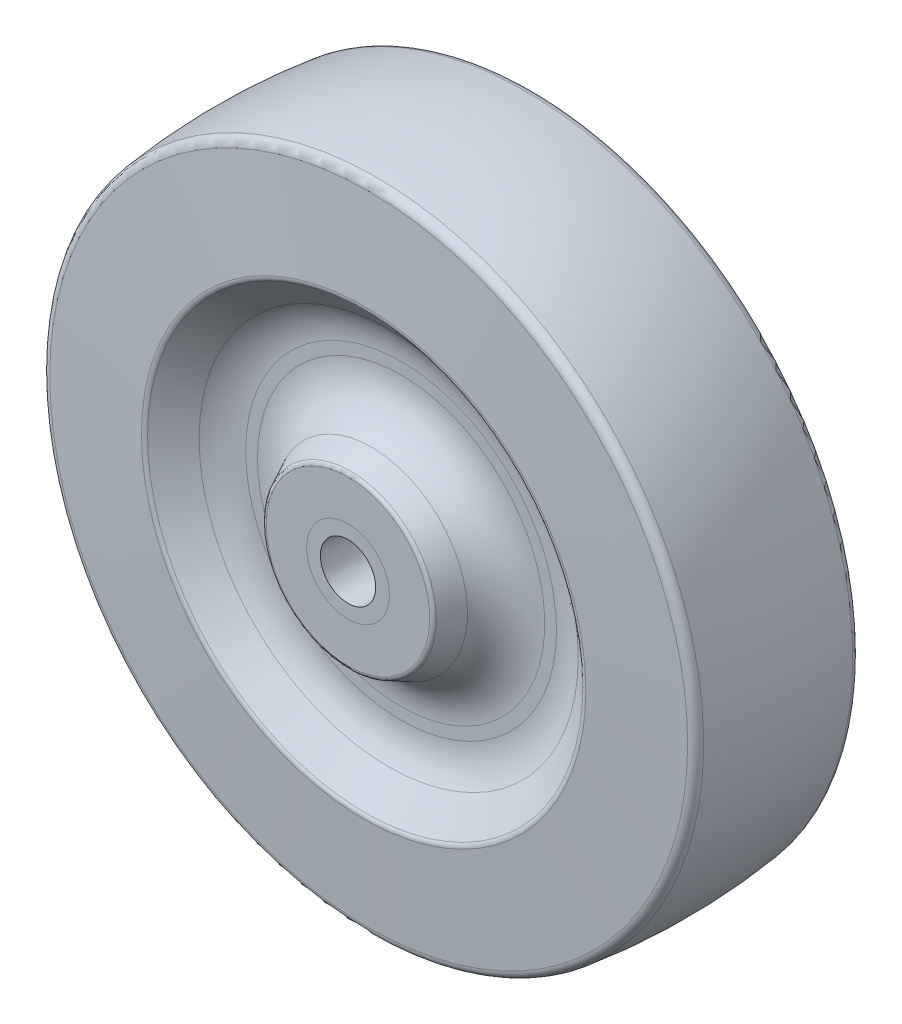
ISO-10303-21;
HEADER;
FILE_DESCRIPTION(('STEP AP214'),'2;1');
FILE_NAME('part.step','',(''),(''),'','','');
FILE_SCHEMA(('AUTOMOTIVE_DESIGN { 1 0 10303 214 1 1 1 1 }'));
ENDSEC;
DATA;
#1=APPLICATION_CONTEXT('core data for automotive mechanical design processes');
#2=APPLICATION_PROTOCOL_DEFINITION('international standard','automotive_design',2000,#1);
#3=PRODUCT_CONTEXT('',#1,'mechanical');
#4=PRODUCT('Part','Part','',(#3));
#5=PRODUCT_RELATED_PRODUCT_CATEGORY('part','',(#4));
#6=PRODUCT_DEFINITION_FORMATION('','',#4);
#7=PRODUCT_DEFINITION_CONTEXT('part definition',#1,'design');
#8=PRODUCT_DEFINITION('design','',#6,#7);
#9=PRODUCT_DEFINITION_SHAPE('','',#8);
#10=(LENGTH_UNIT() NAMED_UNIT(*) SI_UNIT(.MILLI.,.METRE.));
#11=(NAMED_UNIT(*) PLANE_ANGLE_UNIT() SI_UNIT($,.RADIAN.));
#12=(NAMED_UNIT(*) SI_UNIT($,.STERADIAN.) SOLID_ANGLE_UNIT());
#13=UNCERTAINTY_MEASURE_WITH_UNIT(LENGTH_MEASURE(1.E-05),#10,'distance_accuracy_value','');
#14=(GEOMETRIC_REPRESENTATION_CONTEXT(3) GLOBAL_UNCERTAINTY_ASSIGNED_CONTEXT((#13)) GLOBAL_UNIT_ASSIGNED_CONTEXT((#10,
#11,#12)) REPRESENTATION_CONTEXT('',''));
#15=CARTESIAN_POINT('',(0.,0.,0.));
#16=DIRECTION('',(0.,0.,1.));
#17=DIRECTION('',(1.,0.,0.));
#18=AXIS2_PLACEMENT_3D('',#15,#16,#17);
#19=CARTESIAN_POINT('',(0.,0.,11.8237));
#20=DIRECTION('',(0.,0.,-1.));
#21=DIRECTION('',(-1.,0.,0.));
#22=AXIS2_PLACEMENT_3D('',#19,#20,#21);
#23=PLANE('',#22);
#24=CARTESIAN_POINT('',(0.,0.,11.8237));
#25=DIRECTION('',(0.,0.,1.));
#26=DIRECTION('',(1.,0.,0.));
#27=AXIS2_PLACEMENT_3D('',#24,#25,#26);
#28=CIRCLE('',#27,3.175);
#29=CARTESIAN_POINT('',(3.175,0.,11.8237));
#30=VERTEX_POINT('',#29);
#31=EDGE_CURVE('E58',#30,#30,#28,.T.);
#32=ORIENTED_EDGE('',*,*,#31,.F.);
#33=EDGE_LOOP('',(#32));
#34=FACE_BOUND('',#33,.T.);
#35=CARTESIAN_POINT('',(0.,0.,11.8237));
#36=DIRECTION('',(0.,0.,1.));
#37=DIRECTION('',(1.,0.,0.));
#38=AXIS2_PLACEMENT_3D('',#35,#36,#37);
#39=CIRCLE('',#38,4.7498);
#40=CARTESIAN_POINT('',(4.7498,0.,11.8237));
#41=VERTEX_POINT('',#40);
#42=EDGE_CURVE('E50',#41,#41,#39,.T.);
#43=ORIENTED_EDGE('',*,*,#42,.T.);
#44=EDGE_LOOP('',(#43));
#45=FACE_BOUND('',#44,.T.);
#46=ADVANCED_FACE('F44',(#34,#45),#23,.F.);
#47=CARTESIAN_POINT('',(0.,0.,-11.8237));
#48=DIRECTION('',(0.,0.,1.));
#49=DIRECTION('',(1.,0.,0.));
#50=AXIS2_PLACEMENT_3D('',#47,#48,#49);
#51=PLANE('',#50);
#52=CARTESIAN_POINT('',(0.,0.,-11.8237));
#53=DIRECTION('',(0.,0.,1.));
#54=DIRECTION('',(1.,0.,0.));
#55=AXIS2_PLACEMENT_3D('',#52,#53,#54);
#56=CIRCLE('',#55,3.175);
#57=CARTESIAN_POINT('',(3.175,0.,-11.8237));
#58=VERTEX_POINT('',#57);
#59=EDGE_CURVE('E54',#58,#58,#56,.T.);
#60=ORIENTED_EDGE('',*,*,#59,.T.);
#61=EDGE_LOOP('',(#60));
#62=FACE_BOUND('',#61,.T.);
#63=CARTESIAN_POINT('',(0.,0.,-11.8237));
#64=DIRECTION('',(0.,0.,1.));
#65=DIRECTION('',(1.,0.,0.));
#66=AXIS2_PLACEMENT_3D('',#63,#64,#65);
#67=CIRCLE('',#66,4.7498);
#68=CARTESIAN_POINT('',(4.7498,0.,-11.8237));
#69=VERTEX_POINT('',#68);
#70=EDGE_CURVE('E11',#69,#69,#67,.T.);
#71=ORIENTED_EDGE('',*,*,#70,.F.);
#72=EDGE_LOOP('',(#71));
#73=FACE_BOUND('',#72,.T.);
#74=ADVANCED_FACE('F67',(#62,#73),#51,.F.);
#75=CARTESIAN_POINT('',(0.,0.,11.8237));
#76=DIRECTION('',(0.,0.,1.));
#77=DIRECTION('',(1.,0.,0.));
#78=AXIS2_PLACEMENT_3D('',#75,#76,#77);
#79=CYLINDRICAL_SURFACE('',#78,4.7498);
#80=ORIENTED_EDGE('',*,*,#42,.F.);
#81=EDGE_LOOP('',(#80));
#82=FACE_BOUND('',#81,.T.);
#83=ORIENTED_EDGE('',*,*,#70,.T.);
#84=EDGE_LOOP('',(#83));
#85=FACE_BOUND('',#84,.T.);
#86=ADVANCED_FACE('F71',(#82,#85),#79,.T.);
#87=CARTESIAN_POINT('',(0.,0.,-11.8237));
#88=DIRECTION('',(0.,0.,1.));
#89=DIRECTION('',(1.,0.,0.));
#90=AXIS2_PLACEMENT_3D('',#87,#88,#89);
#91=CYLINDRICAL_SURFACE('',#90,3.175);
#92=ORIENTED_EDGE('',*,*,#59,.F.);
#93=EDGE_LOOP('',(#92));
#94=FACE_BOUND('',#93,.T.);
#95=ORIENTED_EDGE('',*,*,#31,.T.);
#96=EDGE_LOOP('',(#95));
#97=FACE_BOUND('',#96,.T.);
#98=ADVANCED_FACE('F64',(#94,#97),#91,.F.);
#99=CLOSED_SHELL('',(#46,#74,#86,#98));
#100=MANIFOLD_SOLID_BREP('B2',#99);
#101=CARTESIAN_POINT('',(0.,9.7028,11.8237));
#102=DIRECTION('',(0.,0.,-1.));
#103=DIRECTION('',(-1.,0.,0.));
#104=AXIS2_PLACEMENT_3D('',#101,#102,#103);
#105=PLANE('',#104);
#106=CARTESIAN_POINT('',(0.,0.,11.8237));
#107=DIRECTION('',(0.,0.,-1.));
#108=DIRECTION('',(-1.,0.,0.));
#109=AXIS2_PLACEMENT_3D('',#106,#107,#108);
#110=CIRCLE('',#109,9.38648594117093);
#111=CARTESIAN_POINT('',(-9.38648594117093,0.,11.8237));
#112=VERTEX_POINT('',#111);
#113=EDGE_CURVE('E120',#112,#112,#110,.F.);
#114=ORIENTED_EDGE('',*,*,#113,.T.);
#115=EDGE_LOOP('',(#114));
#116=FACE_BOUND('',#115,.T.);
#117=CARTESIAN_POINT('',(0.,0.,11.8237));
#118=DIRECTION('',(0.,0.,1.));
#119=DIRECTION('',(1.,0.,0.));
#120=AXIS2_PLACEMENT_3D('',#117,#118,#119);
#121=CIRCLE('',#120,4.7498);
#122=CARTESIAN_POINT('',(4.7498,0.,11.8237));
#123=VERTEX_POINT('',#122);
#124=EDGE_CURVE('E173',#123,#123,#121,.T.);
#125=ORIENTED_EDGE('',*,*,#124,.F.);
#126=EDGE_LOOP('',(#125));
#127=FACE_BOUND('',#126,.T.);
#128=ADVANCED_FACE('F105',(#116,#127),#105,.F.);
#129=CARTESIAN_POINT('',(0.,0.,5.7277));
#130=DIRECTION('',(0.,0.,-1.));
#131=DIRECTION('',(-1.,0.,0.));
#132=AXIS2_PLACEMENT_3D('',#129,#130,#131);
#133=CONICAL_SURFACE('',#132,12.7,0.456958745547133);
#134=CARTESIAN_POINT('',(0.,0.,11.539840234691));
#135=DIRECTION('',(0.,0.,1.));
#136=DIRECTION('',(1.,0.,0.));
#137=AXIS2_PLACEMENT_3D('',#134,#135,#136);
#138=CIRCLE('',#137,9.84236438461026);
#139=CARTESIAN_POINT('',(9.84236438461026,0.,11.539840234691));
#140=VERTEX_POINT('',#139);
#141=EDGE_CURVE('E116',#140,#140,#138,.F.);
#142=ORIENTED_EDGE('',*,*,#141,.T.);
#143=EDGE_LOOP('',(#142));
#144=FACE_BOUND('',#143,.T.);
#145=CARTESIAN_POINT('',(0.,0.,9.13401718370798));
#146=DIRECTION('',(0.,0.,-1.));
#147=DIRECTION('',(-1.,0.,0.));
#148=AXIS2_PLACEMENT_3D('',#145,#146,#147);
#149=CIRCLE('',#148,11.0252273846769);
#150=CARTESIAN_POINT('',(-11.0252273846769,0.,9.13401718370798));
#151=VERTEX_POINT('',#150);
#152=EDGE_CURVE('E158',#151,#151,#149,.F.);
#153=ORIENTED_EDGE('',*,*,#152,.T.);
#154=EDGE_LOOP('',(#153));
#155=FACE_BOUND('',#154,.T.);
#156=ADVANCED_FACE('F197',(#144,#155),#133,.T.);
#157=CARTESIAN_POINT('',(0.,20.066,5.7277));
#158=DIRECTION('',(0.,0.,-1.));
#159=DIRECTION('',(-1.,0.,0.));
#160=AXIS2_PLACEMENT_3D('',#157,#158,#159);
#161=PLANE('',#160);
#162=CARTESIAN_POINT('',(0.,0.,5.7277));
#163=DIRECTION('',(0.,0.,-1.));
#164=DIRECTION('',(-1.,0.,0.));
#165=AXIS2_PLACEMENT_3D('',#162,#163,#164);
#166=CIRCLE('',#165,16.4957687059488);
#167=CARTESIAN_POINT('',(-16.4957687059488,0.,5.7277));
#168=VERTEX_POINT('',#167);
#169=EDGE_CURVE('E152',#168,#168,#166,.T.);
#170=ORIENTED_EDGE('',*,*,#169,.T.);
#171=EDGE_LOOP('',(#170));
#172=FACE_BOUND('',#171,.T.);
#173=CARTESIAN_POINT('',(0.,0.,5.7277));
#174=DIRECTION('',(0.,0.,-1.));
#175=DIRECTION('',(-1.,0.,0.));
#176=AXIS2_PLACEMENT_3D('',#173,#174,#175);
#177=CIRCLE('',#176,17.8472374519132);
#178=CARTESIAN_POINT('',(-17.8472374519132,0.,5.7277));
#179=VERTEX_POINT('',#178);
#180=EDGE_CURVE('E155',#179,#179,#177,.F.);
#181=ORIENTED_EDGE('',*,*,#180,.T.);
#182=EDGE_LOOP('',(#181));
#183=FACE_BOUND('',#182,.T.);
#184=ADVANCED_FACE('F203',(#172,#183),#161,.F.);
#185=CARTESIAN_POINT('',(0.,0.,10.0457));
#186=DIRECTION('',(0.,0.,1.));
#187=DIRECTION('',(1.,0.,0.));
#188=AXIS2_PLACEMENT_3D('',#185,#186,#187);
#189=CONICAL_SURFACE('',#188,25.2119920128217,0.872664625997159);
#190=CARTESIAN_POINT('',(0.,0.,9.85276101093513));
#191=DIRECTION('',(0.,0.,-1.));
#192=DIRECTION('',(-1.,0.,0.));
#193=AXIS2_PLACEMENT_3D('',#190,#191,#192);
#194=CIRCLE('',#193,24.9820562794522);
#195=CARTESIAN_POINT('',(-24.9820562794522,0.,9.85276101093513));
#196=VERTEX_POINT('',#195);
#197=EDGE_CURVE('E134',#196,#196,#194,.F.);
#198=ORIENTED_EDGE('',*,*,#197,.T.);
#199=EDGE_LOOP('',(#198));
#200=FACE_BOUND('',#199,.T.);
#201=CARTESIAN_POINT('',(0.,0.,7.15389307474673));
#202=DIRECTION('',(0.,0.,1.));
#203=DIRECTION('',(1.,0.,0.));
#204=AXIS2_PLACEMENT_3D('',#201,#202,#203);
#205=CIRCLE('',#204,21.7656707205624);
#206=CARTESIAN_POINT('',(21.7656707205624,0.,7.15389307474673));
#207=VERTEX_POINT('',#206);
#208=EDGE_CURVE('E149',#207,#207,#205,.F.);
#209=ORIENTED_EDGE('',*,*,#208,.T.);
#210=EDGE_LOOP('',(#209));
#211=FACE_BOUND('',#210,.T.);
#212=ADVANCED_FACE('F331',(#200,#211),#189,.F.);
#213=CARTESIAN_POINT('',(0.,0.,9.40359297940193));
#214=DIRECTION('',(0.,0.,-1.));
#215=DIRECTION('',(-1.,0.,0.));
#216=AXIS2_PLACEMENT_3D('',#213,#214,#215);
#217=CONICAL_SURFACE('',#216,37.4641238410033,1.51843644923507);
#218=CARTESIAN_POINT('',(0.,0.,10.0299908507615));
#219=DIRECTION('',(0.,0.,1.));
#220=DIRECTION('',(1.,0.,0.));
#221=AXIS2_PLACEMENT_3D('',#218,#219,#220);
#222=CIRCLE('',#221,25.5117404366905);
#223=CARTESIAN_POINT('',(25.5117404366905,0.,10.0299908507615));
#224=VERTEX_POINT('',#223);
#225=EDGE_CURVE('E131',#224,#224,#222,.F.);
#226=ORIENTED_EDGE('',*,*,#225,.T.);
#227=EDGE_LOOP('',(#226));
#228=FACE_BOUND('',#227,.T.);
#229=CARTESIAN_POINT('',(0.,0.,9.44790441551916));
#230=DIRECTION('',(0.,0.,1.));
#231=DIRECTION('',(1.,0.,0.));
#232=AXIS2_PLACEMENT_3D('',#229,#230,#231);
#233=CIRCLE('',#232,36.6186112716209);
#234=CARTESIAN_POINT('',(36.6186112716209,0.,9.44790441551916));
#235=VERTEX_POINT('',#234);
#236=EDGE_CURVE('E170',#235,#235,#233,.T.);
#237=ORIENTED_EDGE('',*,*,#236,.T.);
#238=EDGE_LOOP('',(#237));
#239=FACE_BOUND('',#238,.T.);
#240=ADVANCED_FACE('F326',(#228,#239),#217,.T.);
#241=CARTESIAN_POINT('',(0.,0.,0.));
#242=DIRECTION('',(0.,0.,1.));
#243=DIRECTION('',(1.,0.,0.));
#244=AXIS2_PLACEMENT_3D('',#241,#242,#243);
#245=DEGENERATE_TOROIDAL_SURFACE('',#244,31.75,69.85,.F.);
#246=CARTESIAN_POINT('',(0.,0.,8.55777351386473));
#247=DIRECTION('',(0.,0.,-1.));
#248=DIRECTION('',(-1.,0.,0.));
#249=AXIS2_PLACEMENT_3D('',#246,#247,#248);
#250=CIRCLE('',#249,37.5737838875331);
#251=CARTESIAN_POINT('',(-37.5737838875331,0.,8.55777351386473));
#252=VERTEX_POINT('',#251);
#253=EDGE_CURVE('E164',#252,#252,#250,.T.);
#254=ORIENTED_EDGE('',*,*,#253,.T.);
#255=EDGE_LOOP('',(#254));
#256=FACE_BOUND('',#255,.T.);
#257=CARTESIAN_POINT('',(0.,0.,-8.55777351386473));
#258=DIRECTION('',(0.,0.,1.));
#259=DIRECTION('',(1.,0.,0.));
#260=AXIS2_PLACEMENT_3D('',#257,#258,#259);
#261=CIRCLE('',#260,37.5737838875331);
#262=CARTESIAN_POINT('',(37.5737838875331,0.,-8.55777351386473));
#263=VERTEX_POINT('',#262);
#264=EDGE_CURVE('E167',#263,#263,#261,.T.);
#265=ORIENTED_EDGE('',*,*,#264,.T.);
#266=EDGE_LOOP('',(#265));
#267=FACE_BOUND('',#266,.T.);
#268=ADVANCED_FACE('F318',(#256,#267),#245,.F.);
#269=CARTESIAN_POINT('',(0.,0.,-10.0457));
#270=DIRECTION('',(0.,0.,1.));
#271=DIRECTION('',(1.,0.,0.));
#272=AXIS2_PLACEMENT_3D('',#269,#270,#271);
#273=CONICAL_SURFACE('',#272,25.2119920128217,1.51843644923507);
#274=CARTESIAN_POINT('',(0.,0.,-10.0299908507614));
#275=DIRECTION('',(0.,0.,-1.));
#276=DIRECTION('',(-1.,0.,0.));
#277=AXIS2_PLACEMENT_3D('',#274,#275,#276);
#278=CIRCLE('',#277,25.5117404366905);
#279=CARTESIAN_POINT('',(-25.5117404366905,0.,-10.0299908507614));
#280=VERTEX_POINT('',#279);
#281=EDGE_CURVE('E128',#280,#280,#278,.F.);
#282=ORIENTED_EDGE('',*,*,#281,.T.);
#283=EDGE_LOOP('',(#282));
#284=FACE_BOUND('',#283,.T.);
#285=CARTESIAN_POINT('',(0.,0.,-9.44790441551917));
#286=DIRECTION('',(0.,0.,-1.));
#287=DIRECTION('',(-1.,0.,0.));
#288=AXIS2_PLACEMENT_3D('',#285,#286,#287);
#289=CIRCLE('',#288,36.6186112716209);
#290=CARTESIAN_POINT('',(-36.6186112716209,0.,-9.44790441551917));
#291=VERTEX_POINT('',#290);
#292=EDGE_CURVE('E161',#291,#291,#289,.T.);
#293=ORIENTED_EDGE('',*,*,#292,.T.);
#294=EDGE_LOOP('',(#293));
#295=FACE_BOUND('',#294,.T.);
#296=ADVANCED_FACE('F308',(#284,#295),#273,.T.);
#297=CARTESIAN_POINT('',(0.,0.,-5.7277));
#298=DIRECTION('',(0.,0.,-1.));
#299=DIRECTION('',(-1.,0.,0.));
#300=AXIS2_PLACEMENT_3D('',#297,#298,#299);
#301=CONICAL_SURFACE('',#300,20.066,0.87266462599716);
#302=CARTESIAN_POINT('',(0.,0.,-9.85276101093512));
#303=DIRECTION('',(0.,0.,1.));
#304=DIRECTION('',(1.,0.,0.));
#305=AXIS2_PLACEMENT_3D('',#302,#303,#304);
#306=CIRCLE('',#305,24.9820562794522);
#307=CARTESIAN_POINT('',(24.9820562794522,0.,-9.85276101093512));
#308=VERTEX_POINT('',#307);
#309=EDGE_CURVE('E125',#308,#308,#306,.F.);
#310=ORIENTED_EDGE('',*,*,#309,.T.);
#311=EDGE_LOOP('',(#310));
#312=FACE_BOUND('',#311,.T.);
#313=CARTESIAN_POINT('',(0.,0.,-7.15389307474672));
#314=DIRECTION('',(0.,0.,-1.));
#315=DIRECTION('',(-1.,0.,0.));
#316=AXIS2_PLACEMENT_3D('',#313,#314,#315);
#317=CIRCLE('',#316,21.7656707205624);
#318=CARTESIAN_POINT('',(-21.7656707205624,0.,-7.15389307474672));
#319=VERTEX_POINT('',#318);
#320=EDGE_CURVE('E137',#319,#319,#317,.F.);
#321=ORIENTED_EDGE('',*,*,#320,.T.);
#322=EDGE_LOOP('',(#321));
#323=FACE_BOUND('',#322,.T.);
#324=ADVANCED_FACE('F303',(#312,#323),#301,.F.);
#325=CARTESIAN_POINT('',(0.,20.066,-5.7277));
#326=DIRECTION('',(0.,0.,1.));
#327=DIRECTION('',(1.,0.,0.));
#328=AXIS2_PLACEMENT_3D('',#325,#326,#327);
#329=PLANE('',#328);
#330=CARTESIAN_POINT('',(0.,0.,-5.7277));
#331=DIRECTION('',(0.,0.,1.));
#332=DIRECTION('',(1.,0.,0.));
#333=AXIS2_PLACEMENT_3D('',#330,#331,#332);
#334=CIRCLE('',#333,16.4957687059488);
#335=CARTESIAN_POINT('',(16.4957687059488,0.,-5.7277));
#336=VERTEX_POINT('',#335);
#337=EDGE_CURVE('E143',#336,#336,#334,.T.);
#338=ORIENTED_EDGE('',*,*,#337,.T.);
#339=EDGE_LOOP('',(#338));
#340=FACE_BOUND('',#339,.T.);
#341=CARTESIAN_POINT('',(0.,0.,-5.7277));
#342=DIRECTION('',(0.,0.,1.));
#343=DIRECTION('',(1.,0.,0.));
#344=AXIS2_PLACEMENT_3D('',#341,#342,#343);
#345=CIRCLE('',#344,17.8472374519132);
#346=CARTESIAN_POINT('',(17.8472374519132,0.,-5.7277));
#347=VERTEX_POINT('',#346);
#348=EDGE_CURVE('E146',#347,#347,#345,.F.);
#349=ORIENTED_EDGE('',*,*,#348,.T.);
#350=EDGE_LOOP('',(#349));
#351=FACE_BOUND('',#350,.T.);
#352=ADVANCED_FACE('F272',(#340,#351),#329,.F.);
#353=CARTESIAN_POINT('',(0.,0.,-11.8237));
#354=DIRECTION('',(0.,0.,1.));
#355=DIRECTION('',(1.,0.,0.));
#356=AXIS2_PLACEMENT_3D('',#353,#354,#355);
#357=CONICAL_SURFACE('',#356,9.7028,0.456958745547133);
#358=CARTESIAN_POINT('',(0.,0.,-11.539840234691));
#359=DIRECTION('',(0.,0.,-1.));
#360=DIRECTION('',(-1.,0.,0.));
#361=AXIS2_PLACEMENT_3D('',#358,#359,#360);
#362=CIRCLE('',#361,9.84236438461026);
#363=CARTESIAN_POINT('',(-9.84236438461026,0.,-11.539840234691));
#364=VERTEX_POINT('',#363);
#365=EDGE_CURVE('E112',#364,#364,#362,.F.);
#366=ORIENTED_EDGE('',*,*,#365,.T.);
#367=EDGE_LOOP('',(#366));
#368=FACE_BOUND('',#367,.T.);
#369=CARTESIAN_POINT('',(0.,0.,-9.13401718370798));
#370=DIRECTION('',(0.,0.,1.));
#371=DIRECTION('',(1.,0.,0.));
#372=AXIS2_PLACEMENT_3D('',#369,#370,#371);
#373=CIRCLE('',#372,11.0252273846769);
#374=CARTESIAN_POINT('',(11.0252273846769,0.,-9.13401718370798));
#375=VERTEX_POINT('',#374);
#376=EDGE_CURVE('E140',#375,#375,#373,.F.);
#377=ORIENTED_EDGE('',*,*,#376,.T.);
#378=EDGE_LOOP('',(#377));
#379=FACE_BOUND('',#378,.T.);
#380=ADVANCED_FACE('F194',(#368,#379),#357,.T.);
#381=CARTESIAN_POINT('',(0.,9.7028,-11.8237));
#382=DIRECTION('',(0.,0.,1.));
#383=DIRECTION('',(1.,0.,0.));
#384=AXIS2_PLACEMENT_3D('',#381,#382,#383);
#385=PLANE('',#384);
#386=CARTESIAN_POINT('',(0.,0.,-11.8237));
#387=DIRECTION('',(0.,0.,1.));
#388=DIRECTION('',(1.,0.,0.));
#389=AXIS2_PLACEMENT_3D('',#386,#387,#388);
#390=CIRCLE('',#389,9.38648594117093);
#391=CARTESIAN_POINT('',(9.38648594117093,0.,-11.8237));
#392=VERTEX_POINT('',#391);
#393=EDGE_CURVE('E43',#392,#392,#390,.F.);
#394=ORIENTED_EDGE('',*,*,#393,.T.);
#395=EDGE_LOOP('',(#394));
#396=FACE_BOUND('',#395,.T.);
#397=CARTESIAN_POINT('',(0.,0.,-11.8237));
#398=DIRECTION('',(0.,0.,1.));
#399=DIRECTION('',(1.,0.,0.));
#400=AXIS2_PLACEMENT_3D('',#397,#398,#399);
#401=CIRCLE('',#400,4.7498);
#402=CARTESIAN_POINT('',(4.7498,0.,-11.8237));
#403=VERTEX_POINT('',#402);
#404=EDGE_CURVE('E176',#403,#403,#401,.T.);
#405=ORIENTED_EDGE('',*,*,#404,.T.);
#406=EDGE_LOOP('',(#405));
#407=FACE_BOUND('',#406,.T.);
#408=ADVANCED_FACE('F180',(#396,#407),#385,.F.);
#409=CARTESIAN_POINT('',(0.,0.,11.8237));
#410=DIRECTION('',(0.,0.,1.));
#411=DIRECTION('',(1.,0.,0.));
#412=AXIS2_PLACEMENT_3D('',#409,#410,#411);
#413=CYLINDRICAL_SURFACE('',#412,4.7498);
#414=ORIENTED_EDGE('',*,*,#124,.T.);
#415=EDGE_LOOP('',(#414));
#416=FACE_BOUND('',#415,.T.);
#417=ORIENTED_EDGE('',*,*,#404,.F.);
#418=EDGE_LOOP('',(#417));
#419=FACE_BOUND('',#418,.T.);
#420=ADVANCED_FACE('F182',(#416,#419),#413,.F.);
#421=CARTESIAN_POINT('',(0.,0.,8.43329680820851));
#422=DIRECTION('',(0.,0.,-1.));
#423=DIRECTION('',(-1.,0.,0.));
#424=AXIS2_PLACEMENT_3D('',#421,#422,#423);
#425=TOROIDAL_SURFACE('',#424,36.5654379400781,1.016);
#426=ORIENTED_EDGE('',*,*,#253,.F.);
#427=EDGE_LOOP('',(#426));
#428=FACE_BOUND('',#427,.T.);
#429=ORIENTED_EDGE('',*,*,#236,.F.);
#430=EDGE_LOOP('',(#429));
#431=FACE_BOUND('',#430,.T.);
#432=ADVANCED_FACE('F184',(#428,#431),#425,.T.);
#433=CARTESIAN_POINT('',(0.,0.,-8.43329680820852));
#434=DIRECTION('',(0.,0.,-1.));
#435=DIRECTION('',(-1.,0.,0.));
#436=AXIS2_PLACEMENT_3D('',#433,#434,#435);
#437=TOROIDAL_SURFACE('',#436,36.5654379400781,1.016);
#438=ORIENTED_EDGE('',*,*,#292,.F.);
#439=EDGE_LOOP('',(#438));
#440=FACE_BOUND('',#439,.T.);
#441=ORIENTED_EDGE('',*,*,#264,.F.);
#442=EDGE_LOOP('',(#441));
#443=FACE_BOUND('',#442,.T.);
#444=ADVANCED_FACE('F191',(#440,#443),#437,.T.);
#445=CARTESIAN_POINT('',(0.,0.,11.8237));
#446=DIRECTION('',(0.,0.,-1.));
#447=DIRECTION('',(-1.,0.,0.));
#448=AXIS2_PLACEMENT_3D('',#445,#446,#447);
#449=TOROIDAL_SURFACE('',#448,16.4957687059488,6.096);
#450=ORIENTED_EDGE('',*,*,#169,.F.);
#451=EDGE_LOOP('',(#450));
#452=FACE_BOUND('',#451,.T.);
#453=ORIENTED_EDGE('',*,*,#152,.F.);
#454=EDGE_LOOP('',(#453));
#455=FACE_BOUND('',#454,.T.);
#456=ADVANCED_FACE('F211',(#452,#455),#449,.F.);
#457=CARTESIAN_POINT('',(0.,0.,11.8237));
#458=DIRECTION('',(0.,0.,-1.));
#459=DIRECTION('',(-1.,0.,0.));
#460=AXIS2_PLACEMENT_3D('',#457,#458,#459);
#461=TOROIDAL_SURFACE('',#460,17.8472374519132,6.096);
#462=ORIENTED_EDGE('',*,*,#208,.F.);
#463=EDGE_LOOP('',(#462));
#464=FACE_BOUND('',#463,.T.);
#465=ORIENTED_EDGE('',*,*,#180,.F.);
#466=EDGE_LOOP('',(#465));
#467=FACE_BOUND('',#466,.T.);
#468=ADVANCED_FACE('F215',(#464,#467),#461,.F.);
#469=CARTESIAN_POINT('',(0.,0.,-11.8237));
#470=DIRECTION('',(0.,0.,1.));
#471=DIRECTION('',(1.,0.,0.));
#472=AXIS2_PLACEMENT_3D('',#469,#470,#471);
#473=TOROIDAL_SURFACE('',#472,16.4957687059488,6.096);
#474=ORIENTED_EDGE('',*,*,#376,.F.);
#475=EDGE_LOOP('',(#474));
#476=FACE_BOUND('',#475,.T.);
#477=ORIENTED_EDGE('',*,*,#337,.F.);
#478=EDGE_LOOP('',(#477));
#479=FACE_BOUND('',#478,.T.);
#480=ADVANCED_FACE('F219',(#476,#479),#473,.F.);
#481=CARTESIAN_POINT('',(0.,0.,-11.8237));
#482=DIRECTION('',(0.,0.,1.));
#483=DIRECTION('',(1.,0.,0.));
#484=AXIS2_PLACEMENT_3D('',#481,#482,#483);
#485=TOROIDAL_SURFACE('',#484,17.8472374519132,6.096);
#486=ORIENTED_EDGE('',*,*,#348,.F.);
#487=EDGE_LOOP('',(#486));
#488=FACE_BOUND('',#487,.T.);
#489=ORIENTED_EDGE('',*,*,#320,.F.);
#490=EDGE_LOOP('',(#489));
#491=FACE_BOUND('',#490,.T.);
#492=ADVANCED_FACE('F223',(#488,#491),#485,.F.);
#493=CARTESIAN_POINT('',(0.,0.,9.26903514527847));
#494=DIRECTION('',(0.,0.,-1.));
#495=DIRECTION('',(-1.,0.,0.));
#496=AXIS2_PLACEMENT_3D('',#493,#494,#495);
#497=TOROIDAL_SURFACE('',#496,25.4718604380333,0.762);
#498=ORIENTED_EDGE('',*,*,#225,.F.);
#499=EDGE_LOOP('',(#498));
#500=FACE_BOUND('',#499,.T.);
#501=ORIENTED_EDGE('',*,*,#197,.F.);
#502=EDGE_LOOP('',(#501));
#503=FACE_BOUND('',#502,.T.);
#504=ADVANCED_FACE('F227',(#500,#503),#497,.T.);
#505=CARTESIAN_POINT('',(0.,0.,-9.26903514527846));
#506=DIRECTION('',(0.,0.,-1.));
#507=DIRECTION('',(-1.,0.,0.));
#508=AXIS2_PLACEMENT_3D('',#505,#506,#507);
#509=TOROIDAL_SURFACE('',#508,25.4718604380333,0.762);
#510=ORIENTED_EDGE('',*,*,#309,.F.);
#511=EDGE_LOOP('',(#510));
#512=FACE_BOUND('',#511,.T.);
#513=ORIENTED_EDGE('',*,*,#281,.F.);
#514=EDGE_LOOP('',(#513));
#515=FACE_BOUND('',#514,.T.);
#516=ADVANCED_FACE('F231',(#512,#515),#509,.T.);
#517=CARTESIAN_POINT('',(0.,0.,11.3157));
#518=DIRECTION('',(0.,0.,-1.));
#519=DIRECTION('',(-1.,0.,0.));
#520=AXIS2_PLACEMENT_3D('',#517,#518,#519);
#521=TOROIDAL_SURFACE('',#520,9.38648594117093,0.508);
#522=ORIENTED_EDGE('',*,*,#141,.F.);
#523=EDGE_LOOP('',(#522));
#524=FACE_BOUND('',#523,.T.);
#525=ORIENTED_EDGE('',*,*,#113,.F.);
#526=EDGE_LOOP('',(#525));
#527=FACE_BOUND('',#526,.T.);
#528=ADVANCED_FACE('F234',(#524,#527),#521,.T.);
#529=CARTESIAN_POINT('',(0.,0.,-11.3157));
#530=DIRECTION('',(0.,0.,1.));
#531=DIRECTION('',(1.,0.,0.));
#532=AXIS2_PLACEMENT_3D('',#529,#530,#531);
#533=TOROIDAL_SURFACE('',#532,9.38648594117093,0.508);
#534=ORIENTED_EDGE('',*,*,#393,.F.);
#535=EDGE_LOOP('',(#534));
#536=FACE_BOUND('',#535,.T.);
#537=ORIENTED_EDGE('',*,*,#365,.F.);
#538=EDGE_LOOP('',(#537));
#539=FACE_BOUND('',#538,.T.);
#540=ADVANCED_FACE('F107',(#536,#539),#533,.T.);
#541=CLOSED_SHELL('',(#128,#156,#184,#212,#240,#268,#296,#324,#352,#380,#408,#420,#432,#444,
#456,#468,#480,#492,#504,#516,#528,#540));
#542=MANIFOLD_SOLID_BREP('B6',#541);
#543=ADVANCED_BREP_SHAPE_REPRESENTATION('',(#18,#100,#542),#14);
#544=SHAPE_DEFINITION_REPRESENTATION(#9,#543);
ENDSEC;
END-ISO-10303-21;
